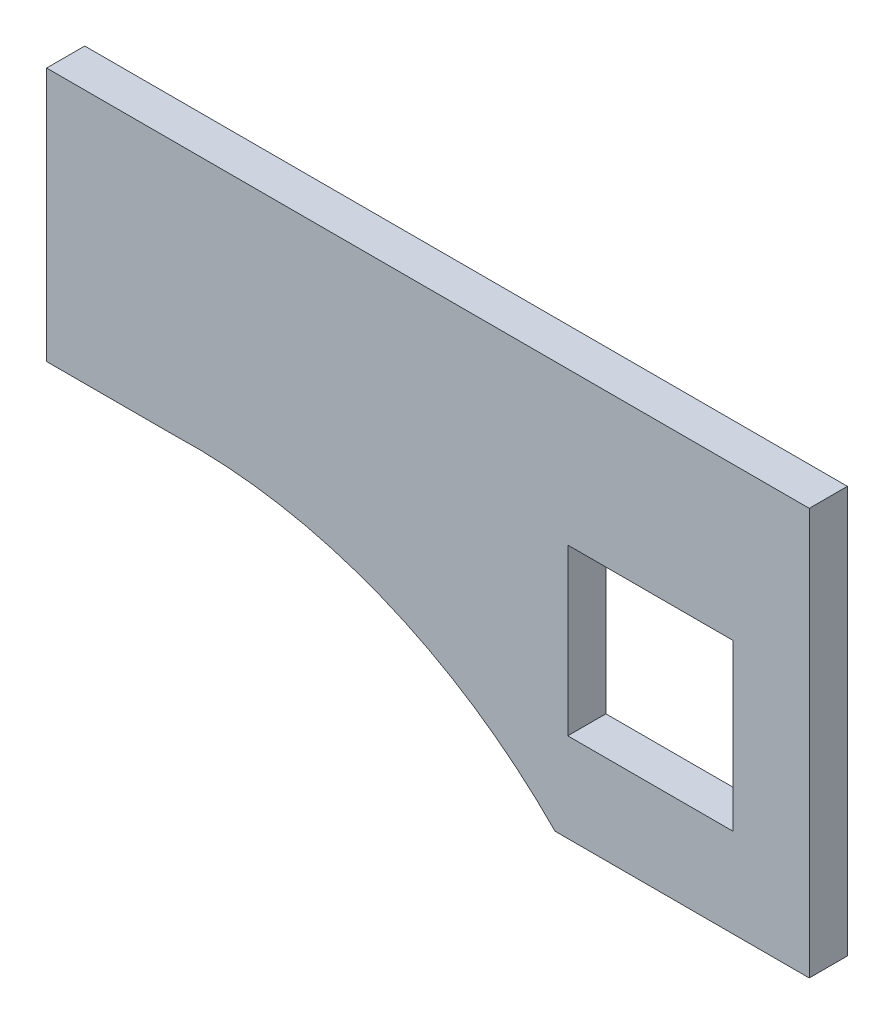
ISO-10303-21;
HEADER;
FILE_DESCRIPTION(('STEP AP214'),'2;1');
FILE_NAME('part.step','',(''),(''),'','','');
FILE_SCHEMA(('AUTOMOTIVE_DESIGN { 1 0 10303 214 1 1 1 1 }'));
ENDSEC;
DATA;
#1=APPLICATION_CONTEXT('core data for automotive mechanical design processes');
#2=APPLICATION_PROTOCOL_DEFINITION('international standard','automotive_design',2000,#1);
#3=PRODUCT_CONTEXT('',#1,'mechanical');
#4=PRODUCT('Part','Part','',(#3));
#5=PRODUCT_RELATED_PRODUCT_CATEGORY('part','',(#4));
#6=PRODUCT_DEFINITION_FORMATION('','',#4);
#7=PRODUCT_DEFINITION_CONTEXT('part definition',#1,'design');
#8=PRODUCT_DEFINITION('design','',#6,#7);
#9=PRODUCT_DEFINITION_SHAPE('','',#8);
#10=(LENGTH_UNIT() NAMED_UNIT(*) SI_UNIT(.MILLI.,.METRE.));
#11=(NAMED_UNIT(*) PLANE_ANGLE_UNIT() SI_UNIT($,.RADIAN.));
#12=(NAMED_UNIT(*) SI_UNIT($,.STERADIAN.) SOLID_ANGLE_UNIT());
#13=UNCERTAINTY_MEASURE_WITH_UNIT(LENGTH_MEASURE(1.E-05),#10,'distance_accuracy_value','');
#14=(GEOMETRIC_REPRESENTATION_CONTEXT(3) GLOBAL_UNCERTAINTY_ASSIGNED_CONTEXT((#13)) GLOBAL_UNIT_ASSIGNED_CONTEXT((#10,
#11,#12)) REPRESENTATION_CONTEXT('',''));
#15=CARTESIAN_POINT('',(0.,0.,0.));
#16=DIRECTION('',(0.,0.,1.));
#17=DIRECTION('',(1.,0.,0.));
#18=AXIS2_PLACEMENT_3D('',#15,#16,#17);
#19=CARTESIAN_POINT('',(22.4828431492981,8.12959880137,1.5));
#20=DIRECTION('',(-1.,0.,0.));
#21=DIRECTION('',(0.,-1.,0.));
#22=AXIS2_PLACEMENT_3D('',#19,#20,#21);
#23=PLANE('',#22);
#24=DIRECTION('',(0.,1.,0.));
#25=VECTOR('',#24,1.);
#26=CARTESIAN_POINT('',(22.4828431492981,8.12959880137,0.));
#27=LINE('',#26,#25);
#28=CARTESIAN_POINT('',(22.4828431492981,-7.87040119863,0.));
#29=VERTEX_POINT('',#28);
#30=CARTESIAN_POINT('',(22.4828431492981,8.12959880137,0.));
#31=VERTEX_POINT('',#30);
#32=EDGE_CURVE('E146',#29,#31,#27,.T.);
#33=ORIENTED_EDGE('',*,*,#32,.T.);
#34=DIRECTION('',(0.,0.,-1.));
#35=VECTOR('',#34,1.);
#36=CARTESIAN_POINT('',(22.4828431492981,8.12959880137,1.5));
#37=LINE('',#36,#35);
#38=CARTESIAN_POINT('',(22.4828431492981,8.12959880137,1.5));
#39=VERTEX_POINT('',#38);
#40=EDGE_CURVE('E208',#39,#31,#37,.T.);
#41=ORIENTED_EDGE('',*,*,#40,.F.);
#42=DIRECTION('',(0.,1.,0.));
#43=VECTOR('',#42,1.);
#44=CARTESIAN_POINT('',(22.4828431492981,8.12959880137,1.5));
#45=LINE('',#44,#43);
#46=CARTESIAN_POINT('',(22.4828431492981,-7.87040119863,1.5));
#47=VERTEX_POINT('',#46);
#48=EDGE_CURVE('E151',#47,#39,#45,.T.);
#49=ORIENTED_EDGE('',*,*,#48,.F.);
#50=DIRECTION('',(0.,0.,-1.));
#51=VECTOR('',#50,1.);
#52=CARTESIAN_POINT('',(22.4828431492981,-7.87040119863,1.5));
#53=LINE('',#52,#51);
#54=EDGE_CURVE('E171',#47,#29,#53,.T.);
#55=ORIENTED_EDGE('',*,*,#54,.T.);
#56=EDGE_LOOP('',(#33,#41,#49,#55));
#57=FACE_BOUND('',#56,.T.);
#58=ADVANCED_FACE('F39',(#57),#23,.F.);
#59=CARTESIAN_POINT('',(-7.51715685070194,8.12959880137,1.5));
#60=DIRECTION('',(0.,-1.,0.));
#61=DIRECTION('',(0.,0.,-1.));
#62=AXIS2_PLACEMENT_3D('',#59,#60,#61);
#63=PLANE('',#62);
#64=DIRECTION('',(-1.,0.,0.));
#65=VECTOR('',#64,1.);
#66=CARTESIAN_POINT('',(-7.51715685070194,8.12959880137,0.));
#67=LINE('',#66,#65);
#68=CARTESIAN_POINT('',(-7.51715685070194,8.12959880137,0.));
#69=VERTEX_POINT('',#68);
#70=EDGE_CURVE('E175',#31,#69,#67,.T.);
#71=ORIENTED_EDGE('',*,*,#70,.T.);
#72=DIRECTION('',(0.,0.,-1.));
#73=VECTOR('',#72,1.);
#74=CARTESIAN_POINT('',(-7.51715685070194,8.12959880137,1.5));
#75=LINE('',#74,#73);
#76=CARTESIAN_POINT('',(-7.51715685070194,8.12959880137,1.5));
#77=VERTEX_POINT('',#76);
#78=EDGE_CURVE('E204',#77,#69,#75,.T.);
#79=ORIENTED_EDGE('',*,*,#78,.F.);
#80=DIRECTION('',(-1.,0.,0.));
#81=VECTOR('',#80,1.);
#82=CARTESIAN_POINT('',(-7.51715685070194,8.12959880137,1.5));
#83=LINE('',#82,#81);
#84=EDGE_CURVE('E155',#39,#77,#83,.T.);
#85=ORIENTED_EDGE('',*,*,#84,.F.);
#86=ORIENTED_EDGE('',*,*,#40,.T.);
#87=EDGE_LOOP('',(#71,#79,#85,#86));
#88=FACE_BOUND('',#87,.T.);
#89=ADVANCED_FACE('F237',(#88),#63,.F.);
#90=CARTESIAN_POINT('',(-7.51715685070194,8.12959880137,1.5));
#91=DIRECTION('',(1.,0.,0.));
#92=DIRECTION('',(0.,0.,-1.));
#93=AXIS2_PLACEMENT_3D('',#90,#91,#92);
#94=PLANE('',#93);
#95=DIRECTION('',(0.,-1.,0.));
#96=VECTOR('',#95,1.);
#97=CARTESIAN_POINT('',(-7.51715685070194,8.12959880137,0.));
#98=LINE('',#97,#96);
#99=CARTESIAN_POINT('',(-7.51715685070194,-1.87040119863,0.));
#100=VERTEX_POINT('',#99);
#101=EDGE_CURVE('E178',#69,#100,#98,.T.);
#102=ORIENTED_EDGE('',*,*,#101,.T.);
#103=DIRECTION('',(0.,0.,-1.));
#104=VECTOR('',#103,1.);
#105=CARTESIAN_POINT('',(-7.51715685070194,-1.87040119863,1.5));
#106=LINE('',#105,#104);
#107=CARTESIAN_POINT('',(-7.51715685070194,-1.87040119863,1.5));
#108=VERTEX_POINT('',#107);
#109=EDGE_CURVE('E200',#108,#100,#106,.T.);
#110=ORIENTED_EDGE('',*,*,#109,.F.);
#111=DIRECTION('',(0.,-1.,0.));
#112=VECTOR('',#111,1.);
#113=CARTESIAN_POINT('',(-7.51715685070194,8.12959880137,1.5));
#114=LINE('',#113,#112);
#115=EDGE_CURVE('E159',#77,#108,#114,.T.);
#116=ORIENTED_EDGE('',*,*,#115,.F.);
#117=ORIENTED_EDGE('',*,*,#78,.T.);
#118=EDGE_LOOP('',(#102,#110,#116,#117));
#119=FACE_BOUND('',#118,.T.);
#120=ADVANCED_FACE('F242',(#119),#94,.F.);
#121=CARTESIAN_POINT('',(-7.51715685070194,-1.87040119863,1.5));
#122=DIRECTION('',(0.,1.,0.));
#123=DIRECTION('',(0.,0.,1.));
#124=AXIS2_PLACEMENT_3D('',#121,#122,#123);
#125=PLANE('',#124);
#126=DIRECTION('',(1.,0.,0.));
#127=VECTOR('',#126,1.);
#128=CARTESIAN_POINT('',(-7.51715685070194,-1.87040119863,0.));
#129=LINE('',#128,#127);
#130=CARTESIAN_POINT('',(-2.51715685070194,-1.87040119863,0.));
#131=VERTEX_POINT('',#130);
#132=EDGE_CURVE('E181',#100,#131,#129,.T.);
#133=ORIENTED_EDGE('',*,*,#132,.T.);
#134=DIRECTION('',(0.,0.,-1.));
#135=VECTOR('',#134,1.);
#136=CARTESIAN_POINT('',(-2.51715685070194,-1.87040119863,1.5));
#137=LINE('',#136,#135);
#138=CARTESIAN_POINT('',(-2.51715685070194,-1.87040119863,1.5));
#139=VERTEX_POINT('',#138);
#140=EDGE_CURVE('E196',#139,#131,#137,.T.);
#141=ORIENTED_EDGE('',*,*,#140,.F.);
#142=DIRECTION('',(1.,0.,0.));
#143=VECTOR('',#142,1.);
#144=CARTESIAN_POINT('',(-7.51715685070194,-1.87040119863,1.5));
#145=LINE('',#144,#143);
#146=EDGE_CURVE('E162',#108,#139,#145,.T.);
#147=ORIENTED_EDGE('',*,*,#146,.F.);
#148=ORIENTED_EDGE('',*,*,#109,.T.);
#149=EDGE_LOOP('',(#133,#141,#147,#148));
#150=FACE_BOUND('',#149,.T.);
#151=ADVANCED_FACE('F263',(#150),#125,.F.);
#152=CARTESIAN_POINT('',(-1.81218545940572,-21.8579727203896,1.5));
#153=DIRECTION('',(0.,0.,-1.));
#154=DIRECTION('',(-1.,0.,0.));
#155=AXIS2_PLACEMENT_3D('',#152,#153,#154);
#156=CYLINDRICAL_SURFACE('',#155,20.);
#157=CARTESIAN_POINT('',(-1.81218545940572,-21.8579727203896,0.));
#158=DIRECTION('',(0.,0.,-1.));
#159=DIRECTION('',(-1.,0.,0.));
#160=AXIS2_PLACEMENT_3D('',#157,#158,#159);
#161=CIRCLE('',#160,20.);
#162=CARTESIAN_POINT('',(12.4828431492981,-7.87040119863,0.));
#163=VERTEX_POINT('',#162);
#164=EDGE_CURVE('E184',#131,#163,#161,.T.);
#165=ORIENTED_EDGE('',*,*,#164,.T.);
#166=DIRECTION('',(0.,0.,-1.));
#167=VECTOR('',#166,1.);
#168=CARTESIAN_POINT('',(12.4828431492981,-7.87040119863,1.5));
#169=LINE('',#168,#167);
#170=CARTESIAN_POINT('',(12.4828431492981,-7.87040119863,1.5));
#171=VERTEX_POINT('',#170);
#172=EDGE_CURVE('E192',#171,#163,#169,.T.);
#173=ORIENTED_EDGE('',*,*,#172,.F.);
#174=CARTESIAN_POINT('',(-1.81218545940572,-21.8579727203896,1.5));
#175=DIRECTION('',(0.,0.,-1.));
#176=DIRECTION('',(-1.,0.,0.));
#177=AXIS2_PLACEMENT_3D('',#174,#175,#176);
#178=CIRCLE('',#177,20.);
#179=EDGE_CURVE('E165',#139,#171,#178,.T.);
#180=ORIENTED_EDGE('',*,*,#179,.F.);
#181=ORIENTED_EDGE('',*,*,#140,.T.);
#182=EDGE_LOOP('',(#165,#173,#180,#181));
#183=FACE_BOUND('',#182,.T.);
#184=ADVANCED_FACE('F260',(#183),#156,.F.);
#185=CARTESIAN_POINT('',(22.4828431492981,-7.87040119863,1.5));
#186=DIRECTION('',(0.,1.,0.));
#187=DIRECTION('',(-1.,0.,0.));
#188=AXIS2_PLACEMENT_3D('',#185,#186,#187);
#189=PLANE('',#188);
#190=DIRECTION('',(1.,0.,0.));
#191=VECTOR('',#190,1.);
#192=CARTESIAN_POINT('',(22.4828431492981,-7.87040119863,0.));
#193=LINE('',#192,#191);
#194=EDGE_CURVE('E156',#163,#29,#193,.T.);
#195=ORIENTED_EDGE('',*,*,#194,.T.);
#196=ORIENTED_EDGE('',*,*,#54,.F.);
#197=DIRECTION('',(1.,0.,0.));
#198=VECTOR('',#197,1.);
#199=CARTESIAN_POINT('',(22.4828431492981,-7.87040119863,1.5));
#200=LINE('',#199,#198);
#201=EDGE_CURVE('E168',#171,#47,#200,.T.);
#202=ORIENTED_EDGE('',*,*,#201,.F.);
#203=ORIENTED_EDGE('',*,*,#172,.T.);
#204=EDGE_LOOP('',(#195,#196,#202,#203));
#205=FACE_BOUND('',#204,.T.);
#206=ADVANCED_FACE('F258',(#205),#189,.F.);
#207=CARTESIAN_POINT('',(-1.81218545940572,-21.8579727203896,1.5));
#208=DIRECTION('',(0.,0.,-1.));
#209=DIRECTION('',(-1.,0.,0.));
#210=AXIS2_PLACEMENT_3D('',#207,#208,#209);
#211=PLANE('',#210);
#212=DIRECTION('',(1.,0.,0.));
#213=VECTOR('',#212,1.);
#214=CARTESIAN_POINT('',(12.9828431492981,-4.37040119863,1.5));
#215=LINE('',#214,#213);
#216=CARTESIAN_POINT('',(12.9828431492981,-4.37040119863,1.5));
#217=VERTEX_POINT('',#216);
#218=CARTESIAN_POINT('',(19.4828431492981,-4.37040119863,1.5));
#219=VERTEX_POINT('',#218);
#220=EDGE_CURVE('E128',#217,#219,#215,.T.);
#221=ORIENTED_EDGE('',*,*,#220,.F.);
#222=DIRECTION('',(0.,-1.,0.));
#223=VECTOR('',#222,1.);
#224=CARTESIAN_POINT('',(12.9828431492981,2.12959880137,1.5));
#225=LINE('',#224,#223);
#226=CARTESIAN_POINT('',(12.9828431492981,2.12959880137,1.5));
#227=VERTEX_POINT('',#226);
#228=EDGE_CURVE('E54',#227,#217,#225,.T.);
#229=ORIENTED_EDGE('',*,*,#228,.F.);
#230=DIRECTION('',(1.,0.,0.));
#231=VECTOR('',#230,1.);
#232=CARTESIAN_POINT('',(12.9828431492981,2.12959880137,1.5));
#233=LINE('',#232,#231);
#234=CARTESIAN_POINT('',(19.4828431492981,2.12959880137,1.5));
#235=VERTEX_POINT('',#234);
#236=EDGE_CURVE('E136',#227,#235,#233,.T.);
#237=ORIENTED_EDGE('',*,*,#236,.T.);
#238=DIRECTION('',(0.,-1.,0.));
#239=VECTOR('',#238,1.);
#240=CARTESIAN_POINT('',(19.4828431492981,2.12959880137,1.5));
#241=LINE('',#240,#239);
#242=EDGE_CURVE('E118',#235,#219,#241,.T.);
#243=ORIENTED_EDGE('',*,*,#242,.T.);
#244=EDGE_LOOP('',(#221,#229,#237,#243));
#245=FACE_BOUND('',#244,.T.);
#246=ORIENTED_EDGE('',*,*,#48,.T.);
#247=ORIENTED_EDGE('',*,*,#84,.T.);
#248=ORIENTED_EDGE('',*,*,#115,.T.);
#249=ORIENTED_EDGE('',*,*,#146,.T.);
#250=ORIENTED_EDGE('',*,*,#179,.T.);
#251=ORIENTED_EDGE('',*,*,#201,.T.);
#252=EDGE_LOOP('',(#246,#247,#248,#249,#250,#251));
#253=FACE_BOUND('',#252,.T.);
#254=ADVANCED_FACE('F133',(#245,#253),#211,.F.);
#255=CARTESIAN_POINT('',(-1.81218545940572,-21.8579727203896,0.));
#256=DIRECTION('',(0.,0.,-1.));
#257=DIRECTION('',(-1.,0.,0.));
#258=AXIS2_PLACEMENT_3D('',#255,#256,#257);
#259=PLANE('',#258);
#260=DIRECTION('',(0.,1.,0.));
#261=VECTOR('',#260,1.);
#262=CARTESIAN_POINT('',(12.9828431492981,-21.8579727203896,0.));
#263=LINE('',#262,#261);
#264=CARTESIAN_POINT('',(12.9828431492981,-4.37040119863,0.));
#265=VERTEX_POINT('',#264);
#266=CARTESIAN_POINT('',(12.9828431492981,2.12959880137,0.));
#267=VERTEX_POINT('',#266);
#268=EDGE_CURVE('E11',#265,#267,#263,.T.);
#269=ORIENTED_EDGE('',*,*,#268,.F.);
#270=DIRECTION('',(-1.,0.,0.));
#271=VECTOR('',#270,1.);
#272=CARTESIAN_POINT('',(-1.81218545940572,-4.37040119863,0.));
#273=LINE('',#272,#271);
#274=CARTESIAN_POINT('',(19.4828431492981,-4.37040119863,0.));
#275=VERTEX_POINT('',#274);
#276=EDGE_CURVE('E212',#275,#265,#273,.T.);
#277=ORIENTED_EDGE('',*,*,#276,.F.);
#278=DIRECTION('',(0.,1.,0.));
#279=VECTOR('',#278,1.);
#280=CARTESIAN_POINT('',(19.4828431492981,-21.8579727203896,0.));
#281=LINE('',#280,#279);
#282=CARTESIAN_POINT('',(19.4828431492981,2.12959880137,0.));
#283=VERTEX_POINT('',#282);
#284=EDGE_CURVE('E121',#275,#283,#281,.T.);
#285=ORIENTED_EDGE('',*,*,#284,.T.);
#286=DIRECTION('',(-1.,0.,0.));
#287=VECTOR('',#286,1.);
#288=CARTESIAN_POINT('',(-1.81218545940572,2.12959880137,0.));
#289=LINE('',#288,#287);
#290=EDGE_CURVE('E47',#283,#267,#289,.T.);
#291=ORIENTED_EDGE('',*,*,#290,.T.);
#292=EDGE_LOOP('',(#269,#277,#285,#291));
#293=FACE_BOUND('',#292,.T.);
#294=ORIENTED_EDGE('',*,*,#32,.F.);
#295=ORIENTED_EDGE('',*,*,#194,.F.);
#296=ORIENTED_EDGE('',*,*,#164,.F.);
#297=ORIENTED_EDGE('',*,*,#132,.F.);
#298=ORIENTED_EDGE('',*,*,#101,.F.);
#299=ORIENTED_EDGE('',*,*,#70,.F.);
#300=EDGE_LOOP('',(#294,#295,#296,#297,#298,#299));
#301=FACE_BOUND('',#300,.T.);
#302=ADVANCED_FACE('F220',(#293,#301),#259,.T.);
#303=CARTESIAN_POINT('',(12.9828431492981,2.12959880137,-0.5));
#304=DIRECTION('',(-1.,0.,0.));
#305=DIRECTION('',(0.,0.,1.));
#306=AXIS2_PLACEMENT_3D('',#303,#304,#305);
#307=PLANE('',#306);
#308=ORIENTED_EDGE('',*,*,#268,.T.);
#309=DIRECTION('',(0.,0.,1.));
#310=VECTOR('',#309,1.);
#311=CARTESIAN_POINT('',(12.9828431492981,2.12959880137,-0.5));
#312=LINE('',#311,#310);
#313=EDGE_CURVE('E143',#267,#227,#312,.T.);
#314=ORIENTED_EDGE('',*,*,#313,.T.);
#315=ORIENTED_EDGE('',*,*,#228,.T.);
#316=DIRECTION('',(0.,0.,1.));
#317=VECTOR('',#316,1.);
#318=CARTESIAN_POINT('',(12.9828431492981,-4.37040119863,-0.5));
#319=LINE('',#318,#317);
#320=EDGE_CURVE('E125',#265,#217,#319,.T.);
#321=ORIENTED_EDGE('',*,*,#320,.F.);
#322=EDGE_LOOP('',(#308,#314,#315,#321));
#323=FACE_BOUND('',#322,.T.);
#324=ADVANCED_FACE('F225',(#323),#307,.F.);
#325=CARTESIAN_POINT('',(12.9828431492981,2.12959880137,-0.5));
#326=DIRECTION('',(0.,-1.,0.));
#327=DIRECTION('',(0.,0.,-1.));
#328=AXIS2_PLACEMENT_3D('',#325,#326,#327);
#329=PLANE('',#328);
#330=DIRECTION('',(0.,0.,1.));
#331=VECTOR('',#330,1.);
#332=CARTESIAN_POINT('',(19.4828431492981,2.12959880137,-0.5));
#333=LINE('',#332,#331);
#334=EDGE_CURVE('E124',#283,#235,#333,.T.);
#335=ORIENTED_EDGE('',*,*,#334,.T.);
#336=ORIENTED_EDGE('',*,*,#236,.F.);
#337=ORIENTED_EDGE('',*,*,#313,.F.);
#338=ORIENTED_EDGE('',*,*,#290,.F.);
#339=EDGE_LOOP('',(#335,#336,#337,#338));
#340=FACE_BOUND('',#339,.T.);
#341=ADVANCED_FACE('F224',(#340),#329,.T.);
#342=CARTESIAN_POINT('',(19.4828431492981,2.12959880137,-0.5));
#343=DIRECTION('',(-1.,0.,0.));
#344=DIRECTION('',(0.,-1.,0.));
#345=AXIS2_PLACEMENT_3D('',#342,#343,#344);
#346=PLANE('',#345);
#347=DIRECTION('',(0.,0.,1.));
#348=VECTOR('',#347,1.);
#349=CARTESIAN_POINT('',(19.4828431492981,-4.37040119863,-0.5));
#350=LINE('',#349,#348);
#351=EDGE_CURVE('E62',#275,#219,#350,.T.);
#352=ORIENTED_EDGE('',*,*,#351,.T.);
#353=ORIENTED_EDGE('',*,*,#242,.F.);
#354=ORIENTED_EDGE('',*,*,#334,.F.);
#355=ORIENTED_EDGE('',*,*,#284,.F.);
#356=EDGE_LOOP('',(#352,#353,#354,#355));
#357=FACE_BOUND('',#356,.T.);
#358=ADVANCED_FACE('F115',(#357),#346,.T.);
#359=CARTESIAN_POINT('',(12.9828431492981,-4.37040119863,-0.5));
#360=DIRECTION('',(0.,-1.,0.));
#361=DIRECTION('',(0.,0.,-1.));
#362=AXIS2_PLACEMENT_3D('',#359,#360,#361);
#363=PLANE('',#362);
#364=ORIENTED_EDGE('',*,*,#276,.T.);
#365=ORIENTED_EDGE('',*,*,#320,.T.);
#366=ORIENTED_EDGE('',*,*,#220,.T.);
#367=ORIENTED_EDGE('',*,*,#351,.F.);
#368=EDGE_LOOP('',(#364,#365,#366,#367));
#369=FACE_BOUND('',#368,.T.);
#370=ADVANCED_FACE('F129',(#369),#363,.F.);
#371=CLOSED_SHELL('',(#58,#89,#120,#151,#184,#206,#254,#302,#324,#341,#358,#370));
#372=MANIFOLD_SOLID_BREP('B2',#371);
#373=ADVANCED_BREP_SHAPE_REPRESENTATION('',(#18,#372),#14);
#374=SHAPE_DEFINITION_REPRESENTATION(#9,#373);
ENDSEC;
END-ISO-10303-21;
